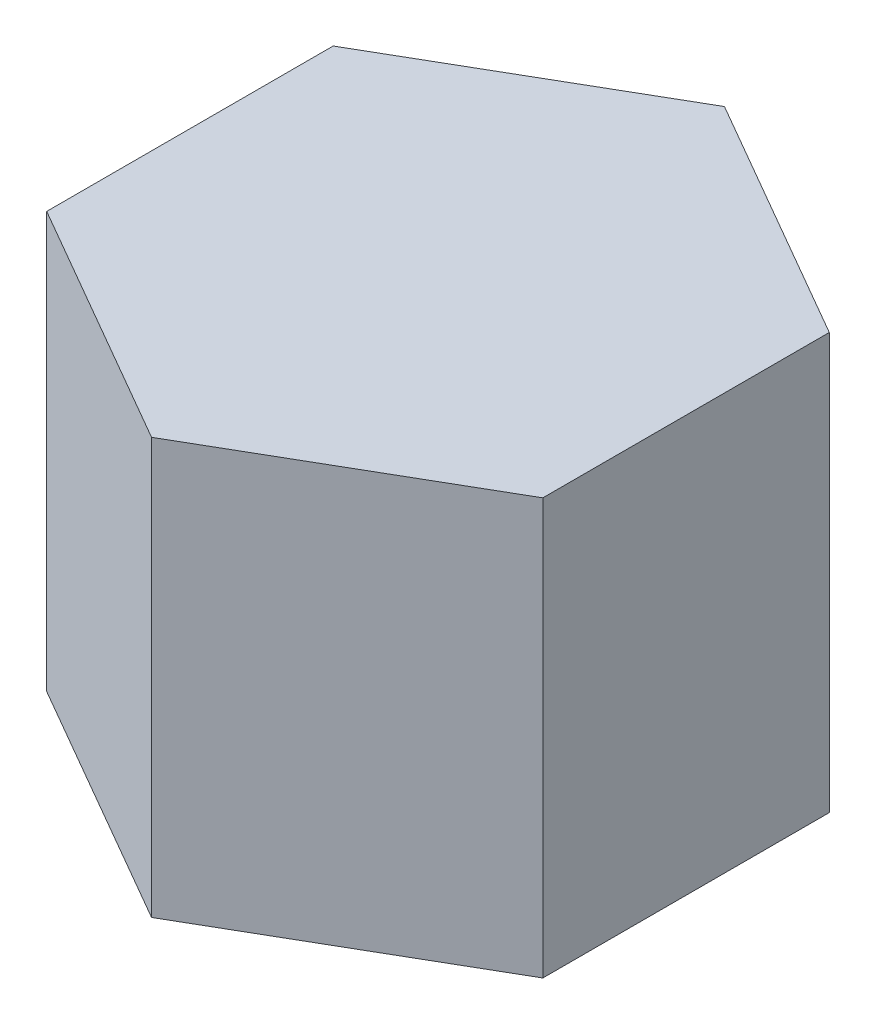
ISO-10303-21;
HEADER;
FILE_DESCRIPTION(('STEP AP214'),'2;1');
FILE_NAME('part.step','',(''),(''),'','','');
FILE_SCHEMA(('AUTOMOTIVE_DESIGN { 1 0 10303 214 1 1 1 1 }'));
ENDSEC;
DATA;
#1=APPLICATION_CONTEXT('core data for automotive mechanical design processes');
#2=APPLICATION_PROTOCOL_DEFINITION('international standard','automotive_design',2000,#1);
#3=PRODUCT_CONTEXT('',#1,'mechanical');
#4=PRODUCT('Part','Part','',(#3));
#5=PRODUCT_RELATED_PRODUCT_CATEGORY('part','',(#4));
#6=PRODUCT_DEFINITION_FORMATION('','',#4);
#7=PRODUCT_DEFINITION_CONTEXT('part definition',#1,'design');
#8=PRODUCT_DEFINITION('design','',#6,#7);
#9=PRODUCT_DEFINITION_SHAPE('','',#8);
#10=(LENGTH_UNIT() NAMED_UNIT(*) SI_UNIT(.MILLI.,.METRE.));
#11=(NAMED_UNIT(*) PLANE_ANGLE_UNIT() SI_UNIT($,.RADIAN.));
#12=(NAMED_UNIT(*) SI_UNIT($,.STERADIAN.) SOLID_ANGLE_UNIT());
#13=UNCERTAINTY_MEASURE_WITH_UNIT(LENGTH_MEASURE(1.E-05),#10,'distance_accuracy_value','');
#14=(GEOMETRIC_REPRESENTATION_CONTEXT(3) GLOBAL_UNCERTAINTY_ASSIGNED_CONTEXT((#13)) GLOBAL_UNIT_ASSIGNED_CONTEXT((#10,
#11,#12)) REPRESENTATION_CONTEXT('',''));
#15=CARTESIAN_POINT('',(0.,0.,0.));
#16=DIRECTION('',(0.,0.,1.));
#17=DIRECTION('',(1.,0.,0.));
#18=AXIS2_PLACEMENT_3D('',#15,#16,#17);
#19=CARTESIAN_POINT('',(204.642660308706,-148.537700895744,289.774920412926));
#20=DIRECTION('',(-0.499999999999943,0.,-0.866025403784472));
#21=DIRECTION('',(-0.866025403784472,0.,0.499999999999943));
#22=AXIS2_PLACEMENT_3D('',#19,#20,#21);
#23=PLANE('',#22);
#24=CARTESIAN_POINT('',(204.339551417382,-149.045793579175,289.949920412926));
#25=DIRECTION('',(0.866025403784471,0.,-0.499999999999943));
#26=VECTOR('',#25,1.);
#27=LINE('',#24,#26);
#28=CARTESIAN_POINT('',(204.339551417382,-149.045793579175,289.949920412926));
#29=VERTEX_POINT('',#28);
#30=CARTESIAN_POINT('',(204.642660308706,-149.045793579175,289.774920412926));
#31=VERTEX_POINT('',#30);
#32=EDGE_CURVE('E170',#29,#31,#27,.T.);
#33=ORIENTED_EDGE('',*,*,#32,.T.);
#34=CARTESIAN_POINT('',(204.642660308706,-148.537700895744,289.774920412926));
#35=DIRECTION('',(0.,-1.,0.));
#36=VECTOR('',#35,1.);
#37=LINE('',#34,#36);
#38=CARTESIAN_POINT('',(204.642660308706,-148.537700895744,289.774920412926));
#39=VERTEX_POINT('',#38);
#40=EDGE_CURVE('E35',#39,#31,#37,.T.);
#41=ORIENTED_EDGE('',*,*,#40,.F.);
#42=CARTESIAN_POINT('',(204.339551417382,-148.537700895744,289.949920412926));
#43=DIRECTION('',(0.866025403784471,0.,-0.499999999999943));
#44=VECTOR('',#43,1.);
#45=LINE('',#42,#44);
#46=CARTESIAN_POINT('',(204.339551417382,-148.537700895744,289.949920412926));
#47=VERTEX_POINT('',#46);
#48=EDGE_CURVE('E159',#47,#39,#45,.T.);
#49=ORIENTED_EDGE('',*,*,#48,.F.);
#50=CARTESIAN_POINT('',(204.339551417382,-148.537700895744,289.949920412926));
#51=DIRECTION('',(0.,-1.,0.));
#52=VECTOR('',#51,1.);
#53=LINE('',#50,#52);
#54=EDGE_CURVE('E10',#47,#29,#53,.T.);
#55=ORIENTED_EDGE('',*,*,#54,.T.);
#56=EDGE_LOOP('',(#33,#41,#49,#55));
#57=FACE_BOUND('',#56,.T.);
#58=ADVANCED_FACE('F16',(#57),#23,.F.);
#59=CARTESIAN_POINT('',(204.339551417382,-148.537700895744,289.949920412926));
#60=DIRECTION('',(0.500000000000062,0.,-0.866025403784403));
#61=DIRECTION('',(-0.866025403784403,0.,-0.500000000000062));
#62=AXIS2_PLACEMENT_3D('',#59,#60,#61);
#63=PLANE('',#62);
#64=CARTESIAN_POINT('',(204.036442526057,-149.045793579175,289.774920412925));
#65=DIRECTION('',(0.866025403784403,0.,0.500000000000062));
#66=VECTOR('',#65,1.);
#67=LINE('',#64,#66);
#68=CARTESIAN_POINT('',(204.036442526057,-149.045793579175,289.774920412925));
#69=VERTEX_POINT('',#68);
#70=EDGE_CURVE('E167',#69,#29,#67,.T.);
#71=ORIENTED_EDGE('',*,*,#70,.T.);
#72=ORIENTED_EDGE('',*,*,#54,.F.);
#73=CARTESIAN_POINT('',(204.036442526057,-148.537700895744,289.774920412925));
#74=DIRECTION('',(0.866025403784403,0.,0.500000000000062));
#75=VECTOR('',#74,1.);
#76=LINE('',#73,#75);
#77=CARTESIAN_POINT('',(204.036442526057,-148.537700895744,289.774920412925));
#78=VERTEX_POINT('',#77);
#79=EDGE_CURVE('E156',#78,#47,#76,.T.);
#80=ORIENTED_EDGE('',*,*,#79,.F.);
#81=CARTESIAN_POINT('',(204.036442526057,-148.537700895744,289.774920412925));
#82=DIRECTION('',(0.,-1.,0.));
#83=VECTOR('',#82,1.);
#84=LINE('',#81,#83);
#85=EDGE_CURVE('E27',#78,#69,#84,.T.);
#86=ORIENTED_EDGE('',*,*,#85,.T.);
#87=EDGE_LOOP('',(#71,#72,#80,#86));
#88=FACE_BOUND('',#87,.T.);
#89=ADVANCED_FACE('F189',(#88),#63,.F.);
#90=CARTESIAN_POINT('',(204.036442526057,-148.537700895744,290.831971220494));
#91=DIRECTION('',(1.,0.,0.));
#92=DIRECTION('',(0.,1.,0.));
#93=AXIS2_PLACEMENT_3D('',#90,#91,#92);
#94=PLANE('',#93);
#95=CARTESIAN_POINT('',(204.036442526057,-149.045793579175,289.424920412926));
#96=DIRECTION('',(0.,0.,1.));
#97=VECTOR('',#96,1.);
#98=LINE('',#95,#97);
#99=CARTESIAN_POINT('',(204.036442526057,-149.045793579175,289.424920412926));
#100=VERTEX_POINT('',#99);
#101=EDGE_CURVE('E163',#100,#69,#98,.T.);
#102=ORIENTED_EDGE('',*,*,#101,.T.);
#103=ORIENTED_EDGE('',*,*,#85,.F.);
#104=CARTESIAN_POINT('',(204.036442526057,-148.537700895744,289.424920412926));
#105=DIRECTION('',(0.,0.,1.));
#106=VECTOR('',#105,1.);
#107=LINE('',#104,#106);
#108=CARTESIAN_POINT('',(204.036442526057,-148.537700895744,289.424920412926));
#109=VERTEX_POINT('',#108);
#110=EDGE_CURVE('E106',#109,#78,#107,.T.);
#111=ORIENTED_EDGE('',*,*,#110,.F.);
#112=CARTESIAN_POINT('',(204.036442526057,-148.537700895744,289.424920412926));
#113=DIRECTION('',(0.,-1.,0.));
#114=VECTOR('',#113,1.);
#115=LINE('',#112,#114);
#116=EDGE_CURVE('E94',#109,#100,#115,.T.);
#117=ORIENTED_EDGE('',*,*,#116,.T.);
#118=EDGE_LOOP('',(#102,#103,#111,#117));
#119=FACE_BOUND('',#118,.T.);
#120=ADVANCED_FACE('F198',(#119),#94,.F.);
#121=CARTESIAN_POINT('',(204.036442526057,-148.537700895744,289.424920412926));
#122=DIRECTION('',(0.499999999999978,0.,0.866025403784452));
#123=DIRECTION('',(0.866025403784452,0.,-0.499999999999978));
#124=AXIS2_PLACEMENT_3D('',#121,#122,#123);
#125=PLANE('',#124);
#126=CARTESIAN_POINT('',(204.339551417382,-149.045793579175,289.249920412926));
#127=DIRECTION('',(-0.866025403784452,0.,0.499999999999978));
#128=VECTOR('',#127,1.);
#129=LINE('',#126,#128);
#130=CARTESIAN_POINT('',(204.339551417382,-149.045793579175,289.249920412926));
#131=VERTEX_POINT('',#130);
#132=EDGE_CURVE('E162',#131,#100,#129,.T.);
#133=ORIENTED_EDGE('',*,*,#132,.T.);
#134=ORIENTED_EDGE('',*,*,#116,.F.);
#135=CARTESIAN_POINT('',(204.339551417382,-148.537700895744,289.249920412926));
#136=DIRECTION('',(-0.866025403784452,0.,0.499999999999978));
#137=VECTOR('',#136,1.);
#138=LINE('',#135,#137);
#139=CARTESIAN_POINT('',(204.339551417382,-148.537700895744,289.249920412926));
#140=VERTEX_POINT('',#139);
#141=EDGE_CURVE('E98',#140,#109,#138,.T.);
#142=ORIENTED_EDGE('',*,*,#141,.F.);
#143=CARTESIAN_POINT('',(204.339551417382,-148.537700895744,289.249920412926));
#144=DIRECTION('',(0.,-1.,0.));
#145=VECTOR('',#144,1.);
#146=LINE('',#143,#145);
#147=EDGE_CURVE('E79',#140,#131,#146,.T.);
#148=ORIENTED_EDGE('',*,*,#147,.T.);
#149=EDGE_LOOP('',(#133,#134,#142,#148));
#150=FACE_BOUND('',#149,.T.);
#151=ADVANCED_FACE('F100',(#150),#125,.F.);
#152=CARTESIAN_POINT('',(204.339551417382,-148.537700895744,289.249920412926));
#153=DIRECTION('',(-0.499999999999978,0.,0.866025403784452));
#154=DIRECTION('',(0.866025403784452,0.,0.499999999999978));
#155=AXIS2_PLACEMENT_3D('',#152,#153,#154);
#156=PLANE('',#155);
#157=CARTESIAN_POINT('',(204.642660308706,-149.045793579175,289.424920412926));
#158=DIRECTION('',(-0.866025403784452,0.,-0.499999999999978));
#159=VECTOR('',#158,1.);
#160=LINE('',#157,#159);
#161=CARTESIAN_POINT('',(204.642660308706,-149.045793579175,289.424920412926));
#162=VERTEX_POINT('',#161);
#163=EDGE_CURVE('E88',#162,#131,#160,.T.);
#164=ORIENTED_EDGE('',*,*,#163,.T.);
#165=ORIENTED_EDGE('',*,*,#147,.F.);
#166=CARTESIAN_POINT('',(204.642660308706,-148.537700895744,289.424920412926));
#167=DIRECTION('',(-0.866025403784452,0.,-0.499999999999978));
#168=VECTOR('',#167,1.);
#169=LINE('',#166,#168);
#170=CARTESIAN_POINT('',(204.642660308706,-148.537700895744,289.424920412926));
#171=VERTEX_POINT('',#170);
#172=EDGE_CURVE('E84',#171,#140,#169,.T.);
#173=ORIENTED_EDGE('',*,*,#172,.F.);
#174=CARTESIAN_POINT('',(204.642660308706,-148.537700895744,289.424920412926));
#175=DIRECTION('',(0.,-1.,0.));
#176=VECTOR('',#175,1.);
#177=LINE('',#174,#176);
#178=EDGE_CURVE('E58',#171,#162,#177,.T.);
#179=ORIENTED_EDGE('',*,*,#178,.T.);
#180=EDGE_LOOP('',(#164,#165,#173,#179));
#181=FACE_BOUND('',#180,.T.);
#182=ADVANCED_FACE('F82',(#181),#156,.F.);
#183=CARTESIAN_POINT('',(204.642660308706,-148.537700895744,290.831971220494));
#184=DIRECTION('',(-1.,0.,0.));
#185=DIRECTION('',(0.,-1.,0.));
#186=AXIS2_PLACEMENT_3D('',#183,#184,#185);
#187=PLANE('',#186);
#188=CARTESIAN_POINT('',(204.642660308706,-149.045793579175,289.774920412926));
#189=DIRECTION('',(0.,0.,-1.));
#190=VECTOR('',#189,1.);
#191=LINE('',#188,#190);
#192=EDGE_CURVE('E160',#31,#162,#191,.T.);
#193=ORIENTED_EDGE('',*,*,#192,.T.);
#194=ORIENTED_EDGE('',*,*,#178,.F.);
#195=CARTESIAN_POINT('',(204.642660308706,-148.537700895744,289.774920412926));
#196=DIRECTION('',(0.,0.,-1.));
#197=VECTOR('',#196,1.);
#198=LINE('',#195,#197);
#199=EDGE_CURVE('E112',#39,#171,#198,.T.);
#200=ORIENTED_EDGE('',*,*,#199,.F.);
#201=ORIENTED_EDGE('',*,*,#40,.T.);
#202=EDGE_LOOP('',(#193,#194,#200,#201));
#203=FACE_BOUND('',#202,.T.);
#204=ADVANCED_FACE('F131',(#203),#187,.F.);
#205=CARTESIAN_POINT('',(206.339551417382,-148.537700895744,290.831971220494));
#206=DIRECTION('',(0.,-1.,0.));
#207=DIRECTION('',(1.,0.,0.));
#208=AXIS2_PLACEMENT_3D('',#205,#206,#207);
#209=PLANE('',#208);
#210=ORIENTED_EDGE('',*,*,#48,.T.);
#211=ORIENTED_EDGE('',*,*,#199,.T.);
#212=ORIENTED_EDGE('',*,*,#172,.T.);
#213=ORIENTED_EDGE('',*,*,#141,.T.);
#214=ORIENTED_EDGE('',*,*,#110,.T.);
#215=ORIENTED_EDGE('',*,*,#79,.T.);
#216=EDGE_LOOP('',(#210,#211,#212,#213,#214,#215));
#217=FACE_BOUND('',#216,.T.);
#218=ADVANCED_FACE('F111',(#217),#209,.F.);
#219=CARTESIAN_POINT('',(206.339551417382,-149.045793579175,290.831971220494));
#220=DIRECTION('',(0.,-1.,0.));
#221=DIRECTION('',(1.,0.,0.));
#222=AXIS2_PLACEMENT_3D('',#219,#220,#221);
#223=PLANE('',#222);
#224=ORIENTED_EDGE('',*,*,#32,.F.);
#225=ORIENTED_EDGE('',*,*,#70,.F.);
#226=ORIENTED_EDGE('',*,*,#101,.F.);
#227=ORIENTED_EDGE('',*,*,#132,.F.);
#228=ORIENTED_EDGE('',*,*,#163,.F.);
#229=ORIENTED_EDGE('',*,*,#192,.F.);
#230=EDGE_LOOP('',(#224,#225,#226,#227,#228,#229));
#231=FACE_BOUND('',#230,.T.);
#232=ADVANCED_FACE('F130',(#231),#223,.T.);
#233=CLOSED_SHELL('',(#58,#89,#120,#151,#182,#204,#218,#232));
#234=MANIFOLD_SOLID_BREP('B1',#233);
#235=ADVANCED_BREP_SHAPE_REPRESENTATION('',(#18,#234),#14);
#236=SHAPE_DEFINITION_REPRESENTATION(#9,#235);
ENDSEC;
END-ISO-10303-21;
